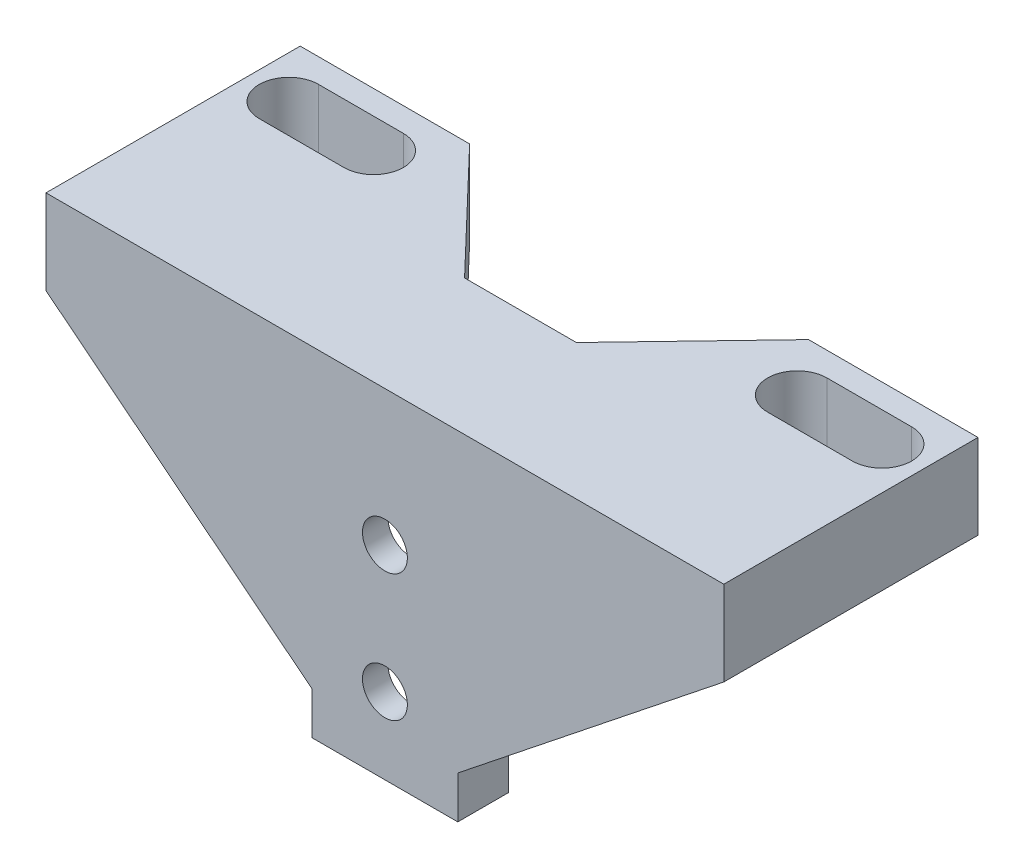
ISO-10303-21;
HEADER;
FILE_DESCRIPTION(('STEP AP214'),'2;1');
FILE_NAME('part.step','',(''),(''),'','','');
FILE_SCHEMA(('AUTOMOTIVE_DESIGN { 1 0 10303 214 1 1 1 1 }'));
ENDSEC;
DATA;
#1=APPLICATION_CONTEXT('core data for automotive mechanical design processes');
#2=APPLICATION_PROTOCOL_DEFINITION('international standard','automotive_design',2000,#1);
#3=PRODUCT_CONTEXT('',#1,'mechanical');
#4=PRODUCT('Part','Part','',(#3));
#5=PRODUCT_RELATED_PRODUCT_CATEGORY('part','',(#4));
#6=PRODUCT_DEFINITION_FORMATION('','',#4);
#7=PRODUCT_DEFINITION_CONTEXT('part definition',#1,'design');
#8=PRODUCT_DEFINITION('design','',#6,#7);
#9=PRODUCT_DEFINITION_SHAPE('','',#8);
#10=(LENGTH_UNIT() NAMED_UNIT(*) SI_UNIT(.MILLI.,.METRE.));
#11=(NAMED_UNIT(*) PLANE_ANGLE_UNIT() SI_UNIT($,.RADIAN.));
#12=(NAMED_UNIT(*) SI_UNIT($,.STERADIAN.) SOLID_ANGLE_UNIT());
#13=UNCERTAINTY_MEASURE_WITH_UNIT(LENGTH_MEASURE(1.E-05),#10,'distance_accuracy_value','');
#14=(GEOMETRIC_REPRESENTATION_CONTEXT(3) GLOBAL_UNCERTAINTY_ASSIGNED_CONTEXT((#13)) GLOBAL_UNIT_ASSIGNED_CONTEXT((#10,
#11,#12)) REPRESENTATION_CONTEXT('',''));
#15=CARTESIAN_POINT('',(0.,0.,0.));
#16=DIRECTION('',(0.,0.,1.));
#17=DIRECTION('',(1.,0.,0.));
#18=AXIS2_PLACEMENT_3D('',#15,#16,#17);
#19=CARTESIAN_POINT('',(0.,12.6831683168317,0.));
#20=DIRECTION('',(0.,1.,0.));
#21=DIRECTION('',(0.,0.,1.));
#22=AXIS2_PLACEMENT_3D('',#19,#20,#21);
#23=PLANE('',#22);
#24=DIRECTION('',(0.,0.,1.));
#25=VECTOR('',#24,1.);
#26=CARTESIAN_POINT('',(-7.03788894806055,12.6831683168317,-3.));
#27=LINE('',#26,#25);
#28=CARTESIAN_POINT('',(-7.03788894806055,12.6831683168317,-13.));
#29=VERTEX_POINT('',#28);
#30=CARTESIAN_POINT('',(-7.03788894806055,12.6831683168317,0.));
#31=VERTEX_POINT('',#30);
#32=EDGE_CURVE('E513',#29,#31,#27,.T.);
#33=ORIENTED_EDGE('',*,*,#32,.F.);
#34=DIRECTION('',(1.,0.,0.));
#35=VECTOR('',#34,1.);
#36=CARTESIAN_POINT('',(-7.03788894806055,12.6831683168317,-13.));
#37=LINE('',#36,#35);
#38=CARTESIAN_POINT('',(6.16211105193945,12.6831683168317,-13.));
#39=VERTEX_POINT('',#38);
#40=EDGE_CURVE('E412',#29,#39,#37,.T.);
#41=ORIENTED_EDGE('',*,*,#40,.T.);
#42=DIRECTION('',(0.,0.,1.));
#43=VECTOR('',#42,1.);
#44=CARTESIAN_POINT('',(6.16211105193945,12.6831683168317,-3.));
#45=LINE('',#44,#43);
#46=CARTESIAN_POINT('',(6.16211105193945,12.6831683168317,0.));
#47=VERTEX_POINT('',#46);
#48=EDGE_CURVE('E534',#39,#47,#45,.T.);
#49=ORIENTED_EDGE('',*,*,#48,.T.);
#50=DIRECTION('',(1.,0.,0.));
#51=VECTOR('',#50,1.);
#52=CARTESIAN_POINT('',(0.,12.6831683168317,0.));
#53=LINE('',#52,#51);
#54=EDGE_CURVE('E544',#31,#47,#53,.T.);
#55=ORIENTED_EDGE('',*,*,#54,.F.);
#56=EDGE_LOOP('',(#33,#41,#49,#55));
#57=FACE_BOUND('',#56,.T.);
#58=ADVANCED_FACE('F92',(#57),#23,.F.);
#59=DIRECTION('',(-1.,0.,0.));
#60=VECTOR('',#59,1.);
#61=CARTESIAN_POINT('',(0.,12.6831683168317,-17.1692178153389));
#62=LINE('',#61,#60);
#63=CARTESIAN_POINT('',(34.5621110519395,12.6831683168317,-17.1692178153389));
#64=VERTEX_POINT('',#63);
#65=CARTESIAN_POINT('',(24.5621110519394,12.6831683168317,-17.1692178153389));
#66=VERTEX_POINT('',#65);
#67=EDGE_CURVE('E352',#64,#66,#62,.T.);
#68=ORIENTED_EDGE('',*,*,#67,.F.);
#69=CARTESIAN_POINT('',(34.5621110519395,12.6831683168317,-20.6692178153389));
#70=DIRECTION('',(0.,1.,0.));
#71=DIRECTION('',(0.,0.,1.));
#72=AXIS2_PLACEMENT_3D('',#69,#70,#71);
#73=CIRCLE('',#72,3.49999999999999);
#74=CARTESIAN_POINT('',(34.5621110519395,12.6831683168317,-24.1692178153389));
#75=VERTEX_POINT('',#74);
#76=EDGE_CURVE('E355',#64,#75,#73,.T.);
#77=ORIENTED_EDGE('',*,*,#76,.T.);
#78=DIRECTION('',(-1.,0.,0.));
#79=VECTOR('',#78,1.);
#80=CARTESIAN_POINT('',(0.,12.6831683168317,-24.1692178153389));
#81=LINE('',#80,#79);
#82=CARTESIAN_POINT('',(24.5621110519394,12.6831683168317,-24.1692178153389));
#83=VERTEX_POINT('',#82);
#84=EDGE_CURVE('E312',#75,#83,#81,.T.);
#85=ORIENTED_EDGE('',*,*,#84,.T.);
#86=CARTESIAN_POINT('',(24.5621110519394,12.6831683168317,-20.6692178153389));
#87=DIRECTION('',(0.,1.,0.));
#88=DIRECTION('',(0.,0.,1.));
#89=AXIS2_PLACEMENT_3D('',#86,#87,#88);
#90=CIRCLE('',#89,3.49999999999999);
#91=EDGE_CURVE('E348',#83,#66,#90,.T.);
#92=ORIENTED_EDGE('',*,*,#91,.T.);
#93=EDGE_LOOP('',(#68,#77,#85,#92));
#94=FACE_BOUND('',#93,.T.);
#95=DIRECTION('',(0.,0.,1.));
#96=VECTOR('',#95,1.);
#97=CARTESIAN_POINT('',(39.5621110519394,12.6831683168317,0.));
#98=LINE('',#97,#96);
#99=CARTESIAN_POINT('',(39.5621110519394,12.6831683168317,-27.));
#100=VERTEX_POINT('',#99);
#101=CARTESIAN_POINT('',(39.5621110519394,12.6831683168317,-13.));
#102=VERTEX_POINT('',#101);
#103=EDGE_CURVE('E449',#100,#102,#98,.T.);
#104=ORIENTED_EDGE('',*,*,#103,.T.);
#105=DIRECTION('',(-1.,0.,0.));
#106=VECTOR('',#105,1.);
#107=CARTESIAN_POINT('',(0.,12.6831683168317,-13.));
#108=LINE('',#107,#106);
#109=EDGE_CURVE('E566',#102,#39,#108,.T.);
#110=ORIENTED_EDGE('',*,*,#109,.T.);
#111=DIRECTION('',(0.691456929285535,0.,-0.722417687313246));
#112=VECTOR('',#111,1.);
#113=CARTESIAN_POINT('',(-3.27784171322789,12.6831683168317,-3.13736278266098));
#114=LINE('',#113,#112);
#115=CARTESIAN_POINT('',(19.5621110519394,12.6831683168317,-27.));
#116=VERTEX_POINT('',#115);
#117=EDGE_CURVE('E456',#39,#116,#114,.T.);
#118=ORIENTED_EDGE('',*,*,#117,.T.);
#119=DIRECTION('',(-1.,0.,0.));
#120=VECTOR('',#119,1.);
#121=CARTESIAN_POINT('',(0.,12.6831683168317,-27.));
#122=LINE('',#121,#120);
#123=EDGE_CURVE('E452',#100,#116,#122,.T.);
#124=ORIENTED_EDGE('',*,*,#123,.F.);
#125=EDGE_LOOP('',(#104,#110,#118,#124));
#126=FACE_BOUND('',#125,.T.);
#127=ADVANCED_FACE('F589',(#94,#126),#23,.F.);
#128=CARTESIAN_POINT('',(8.16211105193945,0.,3.));
#129=DIRECTION('',(1.,0.,0.));
#130=DIRECTION('',(0.,1.,0.));
#131=AXIS2_PLACEMENT_3D('',#128,#129,#130);
#132=PLANE('',#131);
#133=DIRECTION('',(0.,-1.,0.));
#134=VECTOR('',#133,1.);
#135=CARTESIAN_POINT('',(8.16211105193945,0.,-3.));
#136=LINE('',#135,#134);
#137=CARTESIAN_POINT('',(8.16211105193945,-12.3168316831683,-3.00000000000002));
#138=VERTEX_POINT('',#137);
#139=CARTESIAN_POINT('',(8.16211105193945,-17.3168316831683,-3.));
#140=VERTEX_POINT('',#139);
#141=EDGE_CURVE('E520',#138,#140,#136,.T.);
#142=ORIENTED_EDGE('',*,*,#141,.F.);
#143=DIRECTION('',(0.,0.,1.));
#144=VECTOR('',#143,1.);
#145=CARTESIAN_POINT('',(8.16211105193945,-12.3168316831683,-43.136766187624));
#146=LINE('',#145,#144);
#147=CARTESIAN_POINT('',(8.16211105193945,-12.3168316831683,3.));
#148=VERTEX_POINT('',#147);
#149=EDGE_CURVE('E391',#138,#148,#146,.T.);
#150=ORIENTED_EDGE('',*,*,#149,.T.);
#151=DIRECTION('',(0.,-1.,0.));
#152=VECTOR('',#151,1.);
#153=CARTESIAN_POINT('',(8.16211105193945,0.,3.));
#154=LINE('',#153,#152);
#155=CARTESIAN_POINT('',(8.16211105193945,-17.3168316831683,3.));
#156=VERTEX_POINT('',#155);
#157=EDGE_CURVE('E543',#148,#156,#154,.T.);
#158=ORIENTED_EDGE('',*,*,#157,.T.);
#159=DIRECTION('',(0.,0.,-1.));
#160=VECTOR('',#159,1.);
#161=CARTESIAN_POINT('',(8.16211105193945,-17.3168316831683,3.));
#162=LINE('',#161,#160);
#163=EDGE_CURVE('E558',#156,#140,#162,.T.);
#164=ORIENTED_EDGE('',*,*,#163,.T.);
#165=EDGE_LOOP('',(#142,#150,#158,#164));
#166=FACE_BOUND('',#165,.T.);
#167=ADVANCED_FACE('F618',(#166),#132,.T.);
#168=CARTESIAN_POINT('',(0.,0.,0.));
#169=DIRECTION('',(0.,0.,1.));
#170=DIRECTION('',(1.,0.,0.));
#171=AXIS2_PLACEMENT_3D('',#168,#169,#170);
#172=PLANE('',#171);
#173=CARTESIAN_POINT('',(-0.43788894806055,6.68316831683169,0.));
#174=DIRECTION('',(0.,0.,-1.));
#175=DIRECTION('',(-1.,0.,0.));
#176=AXIS2_PLACEMENT_3D('',#173,#174,#175);
#177=CIRCLE('',#176,2.65);
#178=CARTESIAN_POINT('',(-3.08788894806055,6.68316831683169,0.));
#179=VERTEX_POINT('',#178);
#180=EDGE_CURVE('E377',#179,#179,#177,.T.);
#181=ORIENTED_EDGE('',*,*,#180,.F.);
#182=EDGE_LOOP('',(#181));
#183=FACE_BOUND('',#182,.T.);
#184=CARTESIAN_POINT('',(-0.437888948060552,-8.31683168316831,0.));
#185=DIRECTION('',(0.,0.,-1.));
#186=DIRECTION('',(-1.,0.,0.));
#187=AXIS2_PLACEMENT_3D('',#184,#185,#186);
#188=CIRCLE('',#187,2.65);
#189=CARTESIAN_POINT('',(-3.08788894806055,-8.31683168316831,0.));
#190=VERTEX_POINT('',#189);
#191=EDGE_CURVE('E381',#190,#190,#188,.T.);
#192=ORIENTED_EDGE('',*,*,#191,.F.);
#193=EDGE_LOOP('',(#192));
#194=FACE_BOUND('',#193,.T.);
#195=DIRECTION('',(0.,-1.,0.));
#196=VECTOR('',#195,1.);
#197=CARTESIAN_POINT('',(-7.03788894806055,0.,0.));
#198=LINE('',#197,#196);
#199=CARTESIAN_POINT('',(-7.03788894806055,-17.3168316831683,0.));
#200=VERTEX_POINT('',#199);
#201=EDGE_CURVE('E489',#31,#200,#198,.T.);
#202=ORIENTED_EDGE('',*,*,#201,.F.);
#203=ORIENTED_EDGE('',*,*,#54,.T.);
#204=DIRECTION('',(0.,-1.,0.));
#205=VECTOR('',#204,1.);
#206=CARTESIAN_POINT('',(6.16211105193945,0.,0.));
#207=LINE('',#206,#205);
#208=CARTESIAN_POINT('',(6.16211105193945,-17.3168316831683,0.));
#209=VERTEX_POINT('',#208);
#210=EDGE_CURVE('E516',#47,#209,#207,.T.);
#211=ORIENTED_EDGE('',*,*,#210,.T.);
#212=DIRECTION('',(1.,0.,0.));
#213=VECTOR('',#212,1.);
#214=CARTESIAN_POINT('',(0.,-17.3168316831683,0.));
#215=LINE('',#214,#213);
#216=EDGE_CURVE('E538',#200,#209,#215,.T.);
#217=ORIENTED_EDGE('',*,*,#216,.F.);
#218=EDGE_LOOP('',(#202,#203,#211,#217));
#219=FACE_BOUND('',#218,.T.);
#220=ADVANCED_FACE('F630',(#183,#194,#219),#172,.F.);
#221=CARTESIAN_POINT('',(0.,-17.3168316831683,3.));
#222=DIRECTION('',(0.,1.,0.));
#223=DIRECTION('',(0.,0.,1.));
#224=AXIS2_PLACEMENT_3D('',#221,#222,#223);
#225=PLANE('',#224);
#226=DIRECTION('',(0.,0.,-1.));
#227=VECTOR('',#226,1.);
#228=CARTESIAN_POINT('',(-9.03788894806055,-17.3168316831683,3.));
#229=LINE('',#228,#227);
#230=CARTESIAN_POINT('',(-9.03788894806055,-17.3168316831683,3.));
#231=VERTEX_POINT('',#230);
#232=CARTESIAN_POINT('',(-9.03788894806055,-17.3168316831683,-3.));
#233=VERTEX_POINT('',#232);
#234=EDGE_CURVE('E550',#231,#233,#229,.T.);
#235=ORIENTED_EDGE('',*,*,#234,.T.);
#236=DIRECTION('',(-1.,0.,0.));
#237=VECTOR('',#236,1.);
#238=CARTESIAN_POINT('',(0.,-17.3168316831683,-3.));
#239=LINE('',#238,#237);
#240=CARTESIAN_POINT('',(-7.03788894806055,-17.3168316831683,-3.));
#241=VERTEX_POINT('',#240);
#242=EDGE_CURVE('E499',#241,#233,#239,.T.);
#243=ORIENTED_EDGE('',*,*,#242,.F.);
#244=DIRECTION('',(0.,0.,1.));
#245=VECTOR('',#244,1.);
#246=CARTESIAN_POINT('',(-7.03788894806055,-17.3168316831683,-3.));
#247=LINE('',#246,#245);
#248=EDGE_CURVE('E507',#241,#200,#247,.T.);
#249=ORIENTED_EDGE('',*,*,#248,.T.);
#250=ORIENTED_EDGE('',*,*,#216,.T.);
#251=DIRECTION('',(0.,0.,1.));
#252=VECTOR('',#251,1.);
#253=CARTESIAN_POINT('',(6.16211105193945,-17.3168316831683,-3.));
#254=LINE('',#253,#252);
#255=CARTESIAN_POINT('',(6.16211105193945,-17.3168316831683,-3.));
#256=VERTEX_POINT('',#255);
#257=EDGE_CURVE('E527',#256,#209,#254,.T.);
#258=ORIENTED_EDGE('',*,*,#257,.F.);
#259=DIRECTION('',(-1.,0.,0.));
#260=VECTOR('',#259,1.);
#261=CARTESIAN_POINT('',(0.,-17.3168316831683,-3.));
#262=LINE('',#261,#260);
#263=EDGE_CURVE('E523',#140,#256,#262,.T.);
#264=ORIENTED_EDGE('',*,*,#263,.F.);
#265=ORIENTED_EDGE('',*,*,#163,.F.);
#266=DIRECTION('',(1.,0.,0.));
#267=VECTOR('',#266,1.);
#268=CARTESIAN_POINT('',(0.,-17.3168316831683,3.));
#269=LINE('',#268,#267);
#270=EDGE_CURVE('E539',#231,#156,#269,.T.);
#271=ORIENTED_EDGE('',*,*,#270,.F.);
#272=EDGE_LOOP('',(#235,#243,#249,#250,#258,#264,#265,#271));
#273=FACE_BOUND('',#272,.T.);
#274=ADVANCED_FACE('F637',(#273),#225,.F.);
#275=CARTESIAN_POINT('',(-9.03788894806055,0.,3.));
#276=DIRECTION('',(1.,0.,0.));
#277=DIRECTION('',(0.,1.,0.));
#278=AXIS2_PLACEMENT_3D('',#275,#276,#277);
#279=PLANE('',#278);
#280=DIRECTION('',(0.,-1.,0.));
#281=VECTOR('',#280,1.);
#282=CARTESIAN_POINT('',(-9.03788894806055,0.,3.));
#283=LINE('',#282,#281);
#284=CARTESIAN_POINT('',(-9.03788894806055,-12.3168316831683,3.));
#285=VERTEX_POINT('',#284);
#286=EDGE_CURVE('E547',#285,#231,#283,.T.);
#287=ORIENTED_EDGE('',*,*,#286,.F.);
#288=DIRECTION('',(0.,0.,1.));
#289=VECTOR('',#288,1.);
#290=CARTESIAN_POINT('',(-9.03788894806055,-12.3168316831683,-43.136766187624));
#291=LINE('',#290,#289);
#292=CARTESIAN_POINT('',(-9.03788894806055,-12.3168316831683,-3.00000000000002));
#293=VERTEX_POINT('',#292);
#294=EDGE_CURVE('E407',#293,#285,#291,.T.);
#295=ORIENTED_EDGE('',*,*,#294,.F.);
#296=DIRECTION('',(0.,1.,0.));
#297=VECTOR('',#296,1.);
#298=CARTESIAN_POINT('',(-9.03788894806055,0.,-3.));
#299=LINE('',#298,#297);
#300=EDGE_CURVE('E503',#233,#293,#299,.T.);
#301=ORIENTED_EDGE('',*,*,#300,.F.);
#302=ORIENTED_EDGE('',*,*,#234,.F.);
#303=EDGE_LOOP('',(#287,#295,#301,#302));
#304=FACE_BOUND('',#303,.T.);
#305=ADVANCED_FACE('F646',(#304),#279,.F.);
#306=CARTESIAN_POINT('',(0.,0.,3.));
#307=DIRECTION('',(0.,0.,1.));
#308=DIRECTION('',(1.,0.,0.));
#309=AXIS2_PLACEMENT_3D('',#306,#307,#308);
#310=PLANE('',#309);
#311=CARTESIAN_POINT('',(-0.43788894806055,6.68316831683169,3.00000000000001));
#312=DIRECTION('',(0.,0.,-1.));
#313=DIRECTION('',(-1.,0.,0.));
#314=AXIS2_PLACEMENT_3D('',#311,#312,#313);
#315=CIRCLE('',#314,2.65);
#316=CARTESIAN_POINT('',(-3.08788894806055,6.68316831683169,3.00000000000001));
#317=VERTEX_POINT('',#316);
#318=EDGE_CURVE('E373',#317,#317,#315,.T.);
#319=ORIENTED_EDGE('',*,*,#318,.T.);
#320=EDGE_LOOP('',(#319));
#321=FACE_BOUND('',#320,.T.);
#322=CARTESIAN_POINT('',(-0.437888948060552,-8.31683168316831,3.00000000000001));
#323=DIRECTION('',(0.,0.,-1.));
#324=DIRECTION('',(-1.,0.,0.));
#325=AXIS2_PLACEMENT_3D('',#322,#323,#324);
#326=CIRCLE('',#325,2.65);
#327=CARTESIAN_POINT('',(-3.08788894806055,-8.31683168316831,3.00000000000001));
#328=VERTEX_POINT('',#327);
#329=EDGE_CURVE('E372',#328,#328,#326,.T.);
#330=ORIENTED_EDGE('',*,*,#329,.T.);
#331=EDGE_LOOP('',(#330));
#332=FACE_BOUND('',#331,.T.);
#333=ORIENTED_EDGE('',*,*,#157,.F.);
#334=DIRECTION('',(-0.782325109432509,-0.62287031005773,0.));
#335=VECTOR('',#334,1.);
#336=CARTESIAN_POINT('',(9.16846618087928,-11.5155935231844,3.));
#337=LINE('',#336,#335);
#338=CARTESIAN_POINT('',(39.5621110519394,12.6831683168317,3.));
#339=VERTEX_POINT('',#338);
#340=EDGE_CURVE('E388',#339,#148,#337,.T.);
#341=ORIENTED_EDGE('',*,*,#340,.F.);
#342=DIRECTION('',(0.,-1.,0.));
#343=VECTOR('',#342,1.);
#344=CARTESIAN_POINT('',(39.5621110519394,22.6831683168317,3.00000000000001));
#345=LINE('',#344,#343);
#346=CARTESIAN_POINT('',(39.5621110519394,22.6831683168317,3.00000000000001));
#347=VERTEX_POINT('',#346);
#348=EDGE_CURVE('E479',#347,#339,#345,.T.);
#349=ORIENTED_EDGE('',*,*,#348,.F.);
#350=DIRECTION('',(1.,0.,0.));
#351=VECTOR('',#350,1.);
#352=CARTESIAN_POINT('',(0.,22.6831683168317,3.));
#353=LINE('',#352,#351);
#354=CARTESIAN_POINT('',(-40.4378889480606,22.6831683168317,3.00000000000001));
#355=VERTEX_POINT('',#354);
#356=EDGE_CURVE('E421',#355,#347,#353,.T.);
#357=ORIENTED_EDGE('',*,*,#356,.F.);
#358=DIRECTION('',(0.,-1.,0.));
#359=VECTOR('',#358,1.);
#360=CARTESIAN_POINT('',(-40.4378889480606,22.6831683168317,3.00000000000001));
#361=LINE('',#360,#359);
#362=CARTESIAN_POINT('',(-40.4378889480606,12.6831683168317,3.00000000000001));
#363=VERTEX_POINT('',#362);
#364=EDGE_CURVE('E482',#355,#363,#361,.T.);
#365=ORIENTED_EDGE('',*,*,#364,.T.);
#366=DIRECTION('',(0.782325109432509,-0.62287031005773,0.));
#367=VECTOR('',#366,1.);
#368=CARTESIAN_POINT('',(-9.50823947449035,-11.9423487799599,3.));
#369=LINE('',#368,#367);
#370=EDGE_CURVE('E395',#363,#285,#369,.T.);
#371=ORIENTED_EDGE('',*,*,#370,.T.);
#372=ORIENTED_EDGE('',*,*,#286,.T.);
#373=ORIENTED_EDGE('',*,*,#270,.T.);
#374=EDGE_LOOP('',(#333,#341,#349,#357,#365,#371,#372,#373));
#375=FACE_BOUND('',#374,.T.);
#376=ADVANCED_FACE('F615',(#321,#332,#375),#310,.T.);
#377=CARTESIAN_POINT('',(6.16211105193945,0.,-3.));
#378=DIRECTION('',(-1.,0.,0.));
#379=DIRECTION('',(0.,0.,1.));
#380=AXIS2_PLACEMENT_3D('',#377,#378,#379);
#381=PLANE('',#380);
#382=ORIENTED_EDGE('',*,*,#210,.F.);
#383=ORIENTED_EDGE('',*,*,#48,.F.);
#384=DIRECTION('',(0.,-0.707106781186551,0.707106781186544));
#385=VECTOR('',#384,1.);
#386=CARTESIAN_POINT('',(6.16211105193945,2.68316831683163,-3.));
#387=LINE('',#386,#385);
#388=CARTESIAN_POINT('',(6.16211105193945,2.68316831683163,-3.));
#389=VERTEX_POINT('',#388);
#390=EDGE_CURVE('E12',#39,#389,#387,.T.);
#391=ORIENTED_EDGE('',*,*,#390,.T.);
#392=DIRECTION('',(0.,-1.,0.));
#393=VECTOR('',#392,1.);
#394=CARTESIAN_POINT('',(6.16211105193945,0.,-3.));
#395=LINE('',#394,#393);
#396=EDGE_CURVE('E517',#389,#256,#395,.T.);
#397=ORIENTED_EDGE('',*,*,#396,.T.);
#398=ORIENTED_EDGE('',*,*,#257,.T.);
#399=EDGE_LOOP('',(#382,#383,#391,#397,#398));
#400=FACE_BOUND('',#399,.T.);
#401=ADVANCED_FACE('F626',(#400),#381,.T.);
#402=CARTESIAN_POINT('',(0.,0.,-3.));
#403=DIRECTION('',(0.,0.,-1.));
#404=DIRECTION('',(-1.,0.,0.));
#405=AXIS2_PLACEMENT_3D('',#402,#403,#404);
#406=PLANE('',#405);
#407=ORIENTED_EDGE('',*,*,#396,.F.);
#408=DIRECTION('',(1.,0.,0.));
#409=VECTOR('',#408,1.);
#410=CARTESIAN_POINT('',(0.,2.68316831683163,-3.));
#411=LINE('',#410,#409);
#412=CARTESIAN_POINT('',(27.0021110519394,2.68316831683163,-3.));
#413=VERTEX_POINT('',#412);
#414=EDGE_CURVE('E573',#389,#413,#411,.T.);
#415=ORIENTED_EDGE('',*,*,#414,.T.);
#416=DIRECTION('',(-0.782325109432509,-0.62287031005773,0.));
#417=VECTOR('',#416,1.);
#418=CARTESIAN_POINT('',(9.16846618087928,-11.5155935231844,-3.));
#419=LINE('',#418,#417);
#420=EDGE_CURVE('E392',#413,#138,#419,.T.);
#421=ORIENTED_EDGE('',*,*,#420,.T.);
#422=ORIENTED_EDGE('',*,*,#141,.T.);
#423=ORIENTED_EDGE('',*,*,#263,.T.);
#424=EDGE_LOOP('',(#407,#415,#421,#422,#423));
#425=FACE_BOUND('',#424,.T.);
#426=ADVANCED_FACE('F623',(#425),#406,.T.);
#427=CARTESIAN_POINT('',(-7.03788894806055,0.,-3.));
#428=DIRECTION('',(-1.,0.,0.));
#429=DIRECTION('',(0.,-1.,0.));
#430=AXIS2_PLACEMENT_3D('',#427,#428,#429);
#431=PLANE('',#430);
#432=ORIENTED_EDGE('',*,*,#201,.T.);
#433=ORIENTED_EDGE('',*,*,#248,.F.);
#434=DIRECTION('',(0.,-1.,0.));
#435=VECTOR('',#434,1.);
#436=CARTESIAN_POINT('',(-7.03788894806055,0.,-3.));
#437=LINE('',#436,#435);
#438=CARTESIAN_POINT('',(-7.03788894806055,2.68316831683163,-3.));
#439=VERTEX_POINT('',#438);
#440=EDGE_CURVE('E496',#439,#241,#437,.T.);
#441=ORIENTED_EDGE('',*,*,#440,.F.);
#442=DIRECTION('',(0.,0.707106781186551,-0.707106781186544));
#443=VECTOR('',#442,1.);
#444=CARTESIAN_POINT('',(-7.03788894806055,1.3415841584158,-1.65841584158418));
#445=LINE('',#444,#443);
#446=EDGE_CURVE('E576',#439,#29,#445,.T.);
#447=ORIENTED_EDGE('',*,*,#446,.T.);
#448=ORIENTED_EDGE('',*,*,#32,.T.);
#449=EDGE_LOOP('',(#432,#433,#441,#447,#448));
#450=FACE_BOUND('',#449,.T.);
#451=ADVANCED_FACE('F633',(#450),#431,.F.);
#452=CARTESIAN_POINT('',(0.,0.,-3.));
#453=DIRECTION('',(0.,0.,-1.));
#454=DIRECTION('',(-1.,0.,0.));
#455=AXIS2_PLACEMENT_3D('',#452,#453,#454);
#456=PLANE('',#455);
#457=DIRECTION('',(0.782325109432509,-0.62287031005773,0.));
#458=VECTOR('',#457,1.);
#459=CARTESIAN_POINT('',(-9.50823947449035,-11.9423487799599,-3.));
#460=LINE('',#459,#458);
#461=CARTESIAN_POINT('',(-27.8778889480605,2.68316831683164,-3.));
#462=VERTEX_POINT('',#461);
#463=EDGE_CURVE('E404',#462,#293,#460,.T.);
#464=ORIENTED_EDGE('',*,*,#463,.F.);
#465=DIRECTION('',(1.,0.,0.));
#466=VECTOR('',#465,1.);
#467=CARTESIAN_POINT('',(0.,2.68316831683163,-3.));
#468=LINE('',#467,#466);
#469=EDGE_CURVE('E562',#462,#439,#468,.T.);
#470=ORIENTED_EDGE('',*,*,#469,.T.);
#471=ORIENTED_EDGE('',*,*,#440,.T.);
#472=ORIENTED_EDGE('',*,*,#242,.T.);
#473=ORIENTED_EDGE('',*,*,#300,.T.);
#474=EDGE_LOOP('',(#464,#470,#471,#472,#473));
#475=FACE_BOUND('',#474,.T.);
#476=ADVANCED_FACE('F642',(#475),#456,.T.);
#477=CARTESIAN_POINT('',(2.82078433853481,22.6831683168317,-2.69989358116903));
#478=DIRECTION('',(0.722417687313246,0.,-0.691456929285535));
#479=DIRECTION('',(-0.691456929285535,0.,-0.722417687313246));
#480=AXIS2_PLACEMENT_3D('',#477,#478,#479);
#481=PLANE('',#480);
#482=DIRECTION('',(0.691456929285535,0.,0.722417687313246));
#483=VECTOR('',#482,1.);
#484=CARTESIAN_POINT('',(2.82078433853481,12.6831683168317,-2.69989358116903));
#485=LINE('',#484,#483);
#486=CARTESIAN_POINT('',(-20.4378889480606,12.6831683168317,-27.));
#487=VERTEX_POINT('',#486);
#488=EDGE_CURVE('E418',#487,#29,#485,.T.);
#489=ORIENTED_EDGE('',*,*,#488,.F.);
#490=DIRECTION('',(0.,-1.,0.));
#491=VECTOR('',#490,1.);
#492=CARTESIAN_POINT('',(-20.4378889480606,22.6831683168317,-27.));
#493=LINE('',#492,#491);
#494=CARTESIAN_POINT('',(-20.4378889480606,22.6831683168317,-27.));
#495=VERTEX_POINT('',#494);
#496=EDGE_CURVE('E439',#495,#487,#493,.T.);
#497=ORIENTED_EDGE('',*,*,#496,.F.);
#498=DIRECTION('',(0.691456929285535,0.,0.722417687313246));
#499=VECTOR('',#498,1.);
#500=CARTESIAN_POINT('',(2.82078433853481,22.6831683168317,-2.69989358116903));
#501=LINE('',#500,#499);
#502=CARTESIAN_POINT('',(-7.03788894806055,22.6831683168317,-13.));
#503=VERTEX_POINT('',#502);
#504=EDGE_CURVE('E435',#495,#503,#501,.T.);
#505=ORIENTED_EDGE('',*,*,#504,.T.);
#506=DIRECTION('',(0.,-1.,0.));
#507=VECTOR('',#506,1.);
#508=CARTESIAN_POINT('',(-7.03788894806055,22.6831683168317,-13.));
#509=LINE('',#508,#507);
#510=EDGE_CURVE('E465',#503,#29,#509,.T.);
#511=ORIENTED_EDGE('',*,*,#510,.T.);
#512=EDGE_LOOP('',(#489,#497,#505,#511));
#513=FACE_BOUND('',#512,.T.);
#514=ADVANCED_FACE('F659',(#513),#481,.T.);
#515=CARTESIAN_POINT('',(0.,22.6831683168317,-27.));
#516=DIRECTION('',(0.,0.,-1.));
#517=DIRECTION('',(-1.,0.,0.));
#518=AXIS2_PLACEMENT_3D('',#515,#516,#517);
#519=PLANE('',#518);
#520=DIRECTION('',(1.,0.,0.));
#521=VECTOR('',#520,1.);
#522=CARTESIAN_POINT('',(0.,12.6831683168317,-27.));
#523=LINE('',#522,#521);
#524=CARTESIAN_POINT('',(-40.4378889480606,12.6831683168317,-27.));
#525=VERTEX_POINT('',#524);
#526=EDGE_CURVE('E440',#525,#487,#523,.T.);
#527=ORIENTED_EDGE('',*,*,#526,.F.);
#528=DIRECTION('',(0.,-1.,0.));
#529=VECTOR('',#528,1.);
#530=CARTESIAN_POINT('',(-40.4378889480606,22.6831683168317,-27.));
#531=LINE('',#530,#529);
#532=CARTESIAN_POINT('',(-40.4378889480606,22.6831683168317,-27.));
#533=VERTEX_POINT('',#532);
#534=EDGE_CURVE('E486',#533,#525,#531,.T.);
#535=ORIENTED_EDGE('',*,*,#534,.F.);
#536=DIRECTION('',(1.,0.,0.));
#537=VECTOR('',#536,1.);
#538=CARTESIAN_POINT('',(0.,22.6831683168317,-27.));
#539=LINE('',#538,#537);
#540=EDGE_CURVE('E413',#533,#495,#539,.T.);
#541=ORIENTED_EDGE('',*,*,#540,.T.);
#542=ORIENTED_EDGE('',*,*,#496,.T.);
#543=EDGE_LOOP('',(#527,#535,#541,#542));
#544=FACE_BOUND('',#543,.T.);
#545=ADVANCED_FACE('F662',(#544),#519,.T.);
#546=CARTESIAN_POINT('',(-40.4378889480606,22.6831683168317,0.));
#547=DIRECTION('',(1.,0.,0.));
#548=DIRECTION('',(0.,0.,-1.));
#549=AXIS2_PLACEMENT_3D('',#546,#547,#548);
#550=PLANE('',#549);
#551=DIRECTION('',(0.,0.,1.));
#552=VECTOR('',#551,1.);
#553=CARTESIAN_POINT('',(-40.4378889480606,12.6831683168317,0.));
#554=LINE('',#553,#552);
#555=CARTESIAN_POINT('',(-40.4378889480606,12.6831683168317,-13.));
#556=VERTEX_POINT('',#555);
#557=EDGE_CURVE('E444',#525,#556,#554,.T.);
#558=ORIENTED_EDGE('',*,*,#557,.T.);
#559=DIRECTION('',(0.,0.,1.));
#560=VECTOR('',#559,1.);
#561=CARTESIAN_POINT('',(-40.4378889480606,12.6831683168317,-43.136766187624));
#562=LINE('',#561,#560);
#563=EDGE_CURVE('E127',#556,#363,#562,.T.);
#564=ORIENTED_EDGE('',*,*,#563,.T.);
#565=ORIENTED_EDGE('',*,*,#364,.F.);
#566=DIRECTION('',(0.,0.,1.));
#567=VECTOR('',#566,1.);
#568=CARTESIAN_POINT('',(-40.4378889480606,22.6831683168317,0.));
#569=LINE('',#568,#567);
#570=EDGE_CURVE('E417',#533,#355,#569,.T.);
#571=ORIENTED_EDGE('',*,*,#570,.F.);
#572=ORIENTED_EDGE('',*,*,#534,.T.);
#573=EDGE_LOOP('',(#558,#564,#565,#571,#572));
#574=FACE_BOUND('',#573,.T.);
#575=ADVANCED_FACE('F649',(#574),#550,.F.);
#576=CARTESIAN_POINT('',(39.5621110519394,22.6831683168317,0.));
#577=DIRECTION('',(1.,0.,0.));
#578=DIRECTION('',(0.,0.,-1.));
#579=AXIS2_PLACEMENT_3D('',#576,#577,#578);
#580=PLANE('',#579);
#581=ORIENTED_EDGE('',*,*,#103,.F.);
#582=DIRECTION('',(0.,-1.,0.));
#583=VECTOR('',#582,1.);
#584=CARTESIAN_POINT('',(39.5621110519394,22.6831683168317,-27.));
#585=LINE('',#584,#583);
#586=CARTESIAN_POINT('',(39.5621110519394,22.6831683168317,-27.));
#587=VERTEX_POINT('',#586);
#588=EDGE_CURVE('E476',#587,#100,#585,.T.);
#589=ORIENTED_EDGE('',*,*,#588,.F.);
#590=DIRECTION('',(0.,0.,1.));
#591=VECTOR('',#590,1.);
#592=CARTESIAN_POINT('',(39.5621110519394,22.6831683168317,0.));
#593=LINE('',#592,#591);
#594=EDGE_CURVE('E424',#587,#347,#593,.T.);
#595=ORIENTED_EDGE('',*,*,#594,.T.);
#596=ORIENTED_EDGE('',*,*,#348,.T.);
#597=DIRECTION('',(0.,0.,1.));
#598=VECTOR('',#597,1.);
#599=CARTESIAN_POINT('',(39.5621110519394,12.6831683168317,-43.136766187624));
#600=LINE('',#599,#598);
#601=EDGE_CURVE('E108',#102,#339,#600,.T.);
#602=ORIENTED_EDGE('',*,*,#601,.F.);
#603=EDGE_LOOP('',(#581,#589,#595,#596,#602));
#604=FACE_BOUND('',#603,.T.);
#605=ADVANCED_FACE('F605',(#604),#580,.T.);
#606=CARTESIAN_POINT('',(0.,22.6831683168317,-27.));
#607=DIRECTION('',(0.,0.,1.));
#608=DIRECTION('',(1.,0.,0.));
#609=AXIS2_PLACEMENT_3D('',#606,#607,#608);
#610=PLANE('',#609);
#611=ORIENTED_EDGE('',*,*,#123,.T.);
#612=DIRECTION('',(0.,-1.,0.));
#613=VECTOR('',#612,1.);
#614=CARTESIAN_POINT('',(19.5621110519394,22.6831683168317,-27.));
#615=LINE('',#614,#613);
#616=CARTESIAN_POINT('',(19.5621110519394,22.6831683168317,-27.));
#617=VERTEX_POINT('',#616);
#618=EDGE_CURVE('E473',#617,#116,#615,.T.);
#619=ORIENTED_EDGE('',*,*,#618,.F.);
#620=DIRECTION('',(-1.,0.,0.));
#621=VECTOR('',#620,1.);
#622=CARTESIAN_POINT('',(0.,22.6831683168317,-27.));
#623=LINE('',#622,#621);
#624=EDGE_CURVE('E428',#587,#617,#623,.T.);
#625=ORIENTED_EDGE('',*,*,#624,.F.);
#626=ORIENTED_EDGE('',*,*,#588,.T.);
#627=EDGE_LOOP('',(#611,#619,#625,#626));
#628=FACE_BOUND('',#627,.T.);
#629=ADVANCED_FACE('F604',(#628),#610,.F.);
#630=CARTESIAN_POINT('',(-3.27784171322789,22.6831683168317,-3.13736278266098));
#631=DIRECTION('',(-0.722417687313246,0.,-0.691456929285535));
#632=DIRECTION('',(-0.691456929285535,0.,0.722417687313246));
#633=AXIS2_PLACEMENT_3D('',#630,#631,#632);
#634=PLANE('',#633);
#635=ORIENTED_EDGE('',*,*,#117,.F.);
#636=DIRECTION('',(0.,-1.,0.));
#637=VECTOR('',#636,1.);
#638=CARTESIAN_POINT('',(6.16211105193945,22.6831683168317,-13.));
#639=LINE('',#638,#637);
#640=CARTESIAN_POINT('',(6.16211105193945,22.6831683168317,-13.));
#641=VERTEX_POINT('',#640);
#642=EDGE_CURVE('E469',#641,#39,#639,.T.);
#643=ORIENTED_EDGE('',*,*,#642,.F.);
#644=DIRECTION('',(0.691456929285535,0.,-0.722417687313246));
#645=VECTOR('',#644,1.);
#646=CARTESIAN_POINT('',(-3.27784171322789,22.6831683168317,-3.13736278266098));
#647=LINE('',#646,#645);
#648=EDGE_CURVE('E431',#641,#617,#647,.T.);
#649=ORIENTED_EDGE('',*,*,#648,.T.);
#650=ORIENTED_EDGE('',*,*,#618,.T.);
#651=EDGE_LOOP('',(#635,#643,#649,#650));
#652=FACE_BOUND('',#651,.T.);
#653=ADVANCED_FACE('F600',(#652),#634,.T.);
#654=CARTESIAN_POINT('',(-25.4378889480606,12.6831683168317,-20.6692178153389));
#655=DIRECTION('',(0.,1.,0.));
#656=DIRECTION('',(0.,0.,1.));
#657=AXIS2_PLACEMENT_3D('',#654,#655,#656);
#658=CIRCLE('',#657,3.5);
#659=CARTESIAN_POINT('',(-25.4378889480606,12.6831683168317,-17.1692178153389));
#660=VERTEX_POINT('',#659);
#661=CARTESIAN_POINT('',(-25.4378889480606,12.6831683168317,-24.1692178153389));
#662=VERTEX_POINT('',#661);
#663=EDGE_CURVE('E364',#660,#662,#658,.T.);
#664=ORIENTED_EDGE('',*,*,#663,.T.);
#665=DIRECTION('',(-1.,0.,0.));
#666=VECTOR('',#665,1.);
#667=CARTESIAN_POINT('',(0.,12.6831683168317,-24.1692178153389));
#668=LINE('',#667,#666);
#669=CARTESIAN_POINT('',(-35.4378889480606,12.6831683168317,-24.1692178153389));
#670=VERTEX_POINT('',#669);
#671=EDGE_CURVE('E368',#662,#670,#668,.T.);
#672=ORIENTED_EDGE('',*,*,#671,.T.);
#673=CARTESIAN_POINT('',(-35.4378889480606,12.6831683168317,-20.6692178153389));
#674=DIRECTION('',(0.,1.,0.));
#675=DIRECTION('',(0.,0.,1.));
#676=AXIS2_PLACEMENT_3D('',#673,#674,#675);
#677=CIRCLE('',#676,3.5);
#678=CARTESIAN_POINT('',(-35.4378889480606,12.6831683168317,-17.1692178153389));
#679=VERTEX_POINT('',#678);
#680=EDGE_CURVE('E359',#670,#679,#677,.T.);
#681=ORIENTED_EDGE('',*,*,#680,.T.);
#682=DIRECTION('',(-1.,0.,0.));
#683=VECTOR('',#682,1.);
#684=CARTESIAN_POINT('',(0.,12.6831683168317,-17.1692178153389));
#685=LINE('',#684,#683);
#686=EDGE_CURVE('E282',#660,#679,#685,.T.);
#687=ORIENTED_EDGE('',*,*,#686,.F.);
#688=EDGE_LOOP('',(#664,#672,#681,#687));
#689=FACE_BOUND('',#688,.T.);
#690=ORIENTED_EDGE('',*,*,#488,.T.);
#691=DIRECTION('',(-1.,0.,0.));
#692=VECTOR('',#691,1.);
#693=CARTESIAN_POINT('',(0.,12.6831683168317,-13.));
#694=LINE('',#693,#692);
#695=EDGE_CURVE('E570',#29,#556,#694,.T.);
#696=ORIENTED_EDGE('',*,*,#695,.T.);
#697=ORIENTED_EDGE('',*,*,#557,.F.);
#698=ORIENTED_EDGE('',*,*,#526,.T.);
#699=EDGE_LOOP('',(#690,#696,#697,#698));
#700=FACE_BOUND('',#699,.T.);
#701=ADVANCED_FACE('F663',(#689,#700),#23,.F.);
#702=CARTESIAN_POINT('',(0.,22.6831683168317,0.));
#703=DIRECTION('',(0.,1.,0.));
#704=DIRECTION('',(0.,0.,1.));
#705=AXIS2_PLACEMENT_3D('',#702,#703,#704);
#706=PLANE('',#705);
#707=DIRECTION('',(-1.,0.,0.));
#708=VECTOR('',#707,1.);
#709=CARTESIAN_POINT('',(0.,22.6831683168317,-24.1692178153389));
#710=LINE('',#709,#708);
#711=CARTESIAN_POINT('',(-25.4378889480606,22.6831683168317,-24.1692178153389));
#712=VERTEX_POINT('',#711);
#713=CARTESIAN_POINT('',(-35.4378889480606,22.6831683168317,-24.1692178153389));
#714=VERTEX_POINT('',#713);
#715=EDGE_CURVE('E297',#712,#714,#710,.T.);
#716=ORIENTED_EDGE('',*,*,#715,.F.);
#717=CARTESIAN_POINT('',(-25.4378889480606,22.6831683168317,-20.6692178153389));
#718=DIRECTION('',(0.,1.,0.));
#719=DIRECTION('',(0.,0.,1.));
#720=AXIS2_PLACEMENT_3D('',#717,#718,#719);
#721=CIRCLE('',#720,3.5);
#722=CARTESIAN_POINT('',(-25.4378889480606,22.6831683168317,-17.1692178153389));
#723=VERTEX_POINT('',#722);
#724=EDGE_CURVE('E302',#723,#712,#721,.T.);
#725=ORIENTED_EDGE('',*,*,#724,.F.);
#726=DIRECTION('',(-1.,0.,0.));
#727=VECTOR('',#726,1.);
#728=CARTESIAN_POINT('',(0.,22.6831683168317,-17.1692178153389));
#729=LINE('',#728,#727);
#730=CARTESIAN_POINT('',(-35.4378889480606,22.6831683168317,-17.1692178153389));
#731=VERTEX_POINT('',#730);
#732=EDGE_CURVE('E279',#723,#731,#729,.T.);
#733=ORIENTED_EDGE('',*,*,#732,.T.);
#734=CARTESIAN_POINT('',(-35.4378889480606,22.6831683168317,-20.6692178153389));
#735=DIRECTION('',(0.,1.,0.));
#736=DIRECTION('',(0.,0.,1.));
#737=AXIS2_PLACEMENT_3D('',#734,#735,#736);
#738=CIRCLE('',#737,3.5);
#739=EDGE_CURVE('E291',#714,#731,#738,.T.);
#740=ORIENTED_EDGE('',*,*,#739,.F.);
#741=EDGE_LOOP('',(#716,#725,#733,#740));
#742=FACE_BOUND('',#741,.T.);
#743=CARTESIAN_POINT('',(34.5621110519395,22.6831683168317,-20.6692178153389));
#744=DIRECTION('',(0.,1.,0.));
#745=DIRECTION('',(0.,0.,1.));
#746=AXIS2_PLACEMENT_3D('',#743,#744,#745);
#747=CIRCLE('',#746,3.49999999999999);
#748=CARTESIAN_POINT('',(34.5621110519395,22.6831683168317,-17.1692178153389));
#749=VERTEX_POINT('',#748);
#750=CARTESIAN_POINT('',(34.5621110519395,22.6831683168317,-24.1692178153389));
#751=VERTEX_POINT('',#750);
#752=EDGE_CURVE('E342',#749,#751,#747,.T.);
#753=ORIENTED_EDGE('',*,*,#752,.F.);
#754=DIRECTION('',(-1.,0.,0.));
#755=VECTOR('',#754,1.);
#756=CARTESIAN_POINT('',(34.5621110519395,22.6831683168317,-17.1692178153389));
#757=LINE('',#756,#755);
#758=CARTESIAN_POINT('',(24.5621110519394,22.6831683168317,-17.1692178153389));
#759=VERTEX_POINT('',#758);
#760=EDGE_CURVE('E321',#749,#759,#757,.T.);
#761=ORIENTED_EDGE('',*,*,#760,.T.);
#762=CARTESIAN_POINT('',(24.5621110519394,22.6831683168317,-20.6692178153389));
#763=DIRECTION('',(0.,1.,0.));
#764=DIRECTION('',(0.,0.,1.));
#765=AXIS2_PLACEMENT_3D('',#762,#763,#764);
#766=CIRCLE('',#765,3.49999999999999);
#767=CARTESIAN_POINT('',(24.5621110519394,22.6831683168317,-24.1692178153389));
#768=VERTEX_POINT('',#767);
#769=EDGE_CURVE('E334',#768,#759,#766,.T.);
#770=ORIENTED_EDGE('',*,*,#769,.F.);
#771=DIRECTION('',(-1.,0.,0.));
#772=VECTOR('',#771,1.);
#773=CARTESIAN_POINT('',(34.5621110519395,22.6831683168317,-24.1692178153389));
#774=LINE('',#773,#772);
#775=EDGE_CURVE('E338',#751,#768,#774,.T.);
#776=ORIENTED_EDGE('',*,*,#775,.F.);
#777=EDGE_LOOP('',(#753,#761,#770,#776));
#778=FACE_BOUND('',#777,.T.);
#779=ORIENTED_EDGE('',*,*,#648,.F.);
#780=DIRECTION('',(1.,0.,0.));
#781=VECTOR('',#780,1.);
#782=CARTESIAN_POINT('',(-7.03788894806055,22.6831683168317,-13.));
#783=LINE('',#782,#781);
#784=EDGE_CURVE('E445',#503,#641,#783,.T.);
#785=ORIENTED_EDGE('',*,*,#784,.F.);
#786=ORIENTED_EDGE('',*,*,#504,.F.);
#787=ORIENTED_EDGE('',*,*,#540,.F.);
#788=ORIENTED_EDGE('',*,*,#570,.T.);
#789=ORIENTED_EDGE('',*,*,#356,.T.);
#790=ORIENTED_EDGE('',*,*,#594,.F.);
#791=ORIENTED_EDGE('',*,*,#624,.T.);
#792=EDGE_LOOP('',(#779,#785,#786,#787,#788,#789,#790,#791));
#793=FACE_BOUND('',#792,.T.);
#794=ADVANCED_FACE('F299',(#742,#778,#793),#706,.T.);
#795=CARTESIAN_POINT('',(-7.03788894806055,22.6831683168317,-13.));
#796=DIRECTION('',(0.,0.,-1.));
#797=DIRECTION('',(-1.,0.,0.));
#798=AXIS2_PLACEMENT_3D('',#795,#796,#797);
#799=PLANE('',#798);
#800=ORIENTED_EDGE('',*,*,#40,.F.);
#801=ORIENTED_EDGE('',*,*,#510,.F.);
#802=ORIENTED_EDGE('',*,*,#784,.T.);
#803=ORIENTED_EDGE('',*,*,#642,.T.);
#804=EDGE_LOOP('',(#800,#801,#802,#803));
#805=FACE_BOUND('',#804,.T.);
#806=ADVANCED_FACE('F594',(#805),#799,.T.);
#807=CARTESIAN_POINT('',(-9.50823947449035,-11.9423487799599,-43.136766187624));
#808=DIRECTION('',(-0.62287031005773,-0.782325109432509,0.));
#809=DIRECTION('',(0.782325109432509,-0.62287031005773,0.));
#810=AXIS2_PLACEMENT_3D('',#807,#808,#809);
#811=PLANE('',#810);
#812=ORIENTED_EDGE('',*,*,#563,.F.);
#813=DIRECTION('',(0.664045186675209,-0.528698397034402,0.528698397034397));
#814=VECTOR('',#813,1.);
#815=CARTESIAN_POINT('',(-15.5849662717917,-7.10419050185368,6.78735881868521));
#816=LINE('',#815,#814);
#817=EDGE_CURVE('E132',#556,#462,#816,.T.);
#818=ORIENTED_EDGE('',*,*,#817,.T.);
#819=ORIENTED_EDGE('',*,*,#463,.T.);
#820=ORIENTED_EDGE('',*,*,#294,.T.);
#821=ORIENTED_EDGE('',*,*,#370,.F.);
#822=EDGE_LOOP('',(#812,#818,#819,#820,#821));
#823=FACE_BOUND('',#822,.T.);
#824=ADVANCED_FACE('F647',(#823),#811,.T.);
#825=CARTESIAN_POINT('',(9.16846618087928,-11.5155935231844,-43.136766187624));
#826=DIRECTION('',(-0.62287031005773,0.782325109432509,0.));
#827=DIRECTION('',(-0.782325109432509,-0.62287031005773,0.));
#828=AXIS2_PLACEMENT_3D('',#825,#826,#827);
#829=PLANE('',#828);
#830=ORIENTED_EDGE('',*,*,#420,.F.);
#831=DIRECTION('',(0.664045186675209,0.528698397034402,-0.528698397034397));
#832=VECTOR('',#831,1.);
#833=CARTESIAN_POINT('',(28.2445630259468,3.67238167193307,-3.98921335510143));
#834=LINE('',#833,#832);
#835=EDGE_CURVE('E101',#413,#102,#834,.T.);
#836=ORIENTED_EDGE('',*,*,#835,.T.);
#837=ORIENTED_EDGE('',*,*,#601,.T.);
#838=ORIENTED_EDGE('',*,*,#340,.T.);
#839=ORIENTED_EDGE('',*,*,#149,.F.);
#840=EDGE_LOOP('',(#830,#836,#837,#838,#839));
#841=FACE_BOUND('',#840,.T.);
#842=ADVANCED_FACE('F584',(#841),#829,.F.);
#843=CARTESIAN_POINT('',(-0.437888948060552,-8.31683168316831,3.00000000000001));
#844=DIRECTION('',(0.,0.,-1.));
#845=DIRECTION('',(-1.,0.,0.));
#846=AXIS2_PLACEMENT_3D('',#843,#844,#845);
#847=CYLINDRICAL_SURFACE('',#846,2.65);
#848=ORIENTED_EDGE('',*,*,#191,.T.);
#849=EDGE_LOOP('',(#848));
#850=FACE_BOUND('',#849,.T.);
#851=ORIENTED_EDGE('',*,*,#329,.F.);
#852=EDGE_LOOP('',(#851));
#853=FACE_BOUND('',#852,.T.);
#854=ADVANCED_FACE('F717',(#850,#853),#847,.F.);
#855=CARTESIAN_POINT('',(-0.43788894806055,6.68316831683169,3.00000000000001));
#856=DIRECTION('',(0.,0.,-1.));
#857=DIRECTION('',(-1.,0.,0.));
#858=AXIS2_PLACEMENT_3D('',#855,#856,#857);
#859=CYLINDRICAL_SURFACE('',#858,2.65);
#860=ORIENTED_EDGE('',*,*,#318,.F.);
#861=EDGE_LOOP('',(#860));
#862=FACE_BOUND('',#861,.T.);
#863=ORIENTED_EDGE('',*,*,#180,.T.);
#864=EDGE_LOOP('',(#863));
#865=FACE_BOUND('',#864,.T.);
#866=ADVANCED_FACE('F714',(#862,#865),#859,.F.);
#867=CARTESIAN_POINT('',(34.5621110519395,-17.3168316831683,-20.6692178153389));
#868=DIRECTION('',(0.,1.,0.));
#869=DIRECTION('',(0.,0.,1.));
#870=AXIS2_PLACEMENT_3D('',#867,#868,#869);
#871=CYLINDRICAL_SURFACE('',#870,3.49999999999999);
#872=DIRECTION('',(0.,1.,0.));
#873=VECTOR('',#872,1.);
#874=CARTESIAN_POINT('',(34.5621110519395,-17.3168316831683,-17.1692178153389));
#875=LINE('',#874,#873);
#876=EDGE_CURVE('E328',#64,#749,#875,.T.);
#877=ORIENTED_EDGE('',*,*,#876,.T.);
#878=ORIENTED_EDGE('',*,*,#752,.T.);
#879=DIRECTION('',(0.,1.,0.));
#880=VECTOR('',#879,1.);
#881=CARTESIAN_POINT('',(34.5621110519395,-17.3168316831683,-24.1692178153389));
#882=LINE('',#881,#880);
#883=EDGE_CURVE('E317',#75,#751,#882,.T.);
#884=ORIENTED_EDGE('',*,*,#883,.F.);
#885=ORIENTED_EDGE('',*,*,#76,.F.);
#886=EDGE_LOOP('',(#877,#878,#884,#885));
#887=FACE_BOUND('',#886,.T.);
#888=ADVANCED_FACE('F696',(#887),#871,.F.);
#889=CARTESIAN_POINT('',(34.5621110519395,-17.3168316831683,-17.1692178153389));
#890=DIRECTION('',(0.,0.,-1.));
#891=DIRECTION('',(-1.,0.,0.));
#892=AXIS2_PLACEMENT_3D('',#889,#890,#891);
#893=PLANE('',#892);
#894=ORIENTED_EDGE('',*,*,#67,.T.);
#895=DIRECTION('',(0.,1.,0.));
#896=VECTOR('',#895,1.);
#897=CARTESIAN_POINT('',(24.5621110519394,-17.3168316831683,-17.1692178153389));
#898=LINE('',#897,#896);
#899=EDGE_CURVE('E325',#66,#759,#898,.T.);
#900=ORIENTED_EDGE('',*,*,#899,.T.);
#901=ORIENTED_EDGE('',*,*,#760,.F.);
#902=ORIENTED_EDGE('',*,*,#876,.F.);
#903=EDGE_LOOP('',(#894,#900,#901,#902));
#904=FACE_BOUND('',#903,.T.);
#905=ADVANCED_FACE('F687',(#904),#893,.T.);
#906=CARTESIAN_POINT('',(24.5621110519394,-17.3168316831683,-20.6692178153389));
#907=DIRECTION('',(0.,1.,0.));
#908=DIRECTION('',(0.,0.,1.));
#909=AXIS2_PLACEMENT_3D('',#906,#907,#908);
#910=CYLINDRICAL_SURFACE('',#909,3.49999999999999);
#911=DIRECTION('',(0.,1.,0.));
#912=VECTOR('',#911,1.);
#913=CARTESIAN_POINT('',(24.5621110519394,-17.3168316831683,-24.1692178153389));
#914=LINE('',#913,#912);
#915=EDGE_CURVE('E322',#83,#768,#914,.T.);
#916=ORIENTED_EDGE('',*,*,#915,.T.);
#917=ORIENTED_EDGE('',*,*,#769,.T.);
#918=ORIENTED_EDGE('',*,*,#899,.F.);
#919=ORIENTED_EDGE('',*,*,#91,.F.);
#920=EDGE_LOOP('',(#916,#917,#918,#919));
#921=FACE_BOUND('',#920,.T.);
#922=ADVANCED_FACE('F690',(#921),#910,.F.);
#923=CARTESIAN_POINT('',(34.5621110519395,-17.3168316831683,-24.1692178153389));
#924=DIRECTION('',(0.,0.,-1.));
#925=DIRECTION('',(-1.,0.,0.));
#926=AXIS2_PLACEMENT_3D('',#923,#924,#925);
#927=PLANE('',#926);
#928=ORIENTED_EDGE('',*,*,#883,.T.);
#929=ORIENTED_EDGE('',*,*,#775,.T.);
#930=ORIENTED_EDGE('',*,*,#915,.F.);
#931=ORIENTED_EDGE('',*,*,#84,.F.);
#932=EDGE_LOOP('',(#928,#929,#930,#931));
#933=FACE_BOUND('',#932,.T.);
#934=ADVANCED_FACE('F698',(#933),#927,.F.);
#935=CARTESIAN_POINT('',(0.,-17.3168316831683,-24.1692178153389));
#936=DIRECTION('',(0.,0.,-1.));
#937=DIRECTION('',(-1.,0.,0.));
#938=AXIS2_PLACEMENT_3D('',#935,#936,#937);
#939=PLANE('',#938);
#940=DIRECTION('',(0.,1.,0.));
#941=VECTOR('',#940,1.);
#942=CARTESIAN_POINT('',(-25.4378889480606,-17.3168316831683,-24.1692178153389));
#943=LINE('',#942,#941);
#944=EDGE_CURVE('E309',#662,#712,#943,.T.);
#945=ORIENTED_EDGE('',*,*,#944,.T.);
#946=ORIENTED_EDGE('',*,*,#715,.T.);
#947=DIRECTION('',(0.,1.,0.));
#948=VECTOR('',#947,1.);
#949=CARTESIAN_POINT('',(-35.4378889480606,-17.3168316831683,-24.1692178153389));
#950=LINE('',#949,#948);
#951=EDGE_CURVE('E287',#670,#714,#950,.T.);
#952=ORIENTED_EDGE('',*,*,#951,.F.);
#953=ORIENTED_EDGE('',*,*,#671,.F.);
#954=EDGE_LOOP('',(#945,#946,#952,#953));
#955=FACE_BOUND('',#954,.T.);
#956=ADVANCED_FACE('F700',(#955),#939,.F.);
#957=CARTESIAN_POINT('',(-25.4378889480606,-17.3168316831683,-20.6692178153389));
#958=DIRECTION('',(0.,1.,0.));
#959=DIRECTION('',(0.,0.,1.));
#960=AXIS2_PLACEMENT_3D('',#957,#958,#959);
#961=CYLINDRICAL_SURFACE('',#960,3.5);
#962=DIRECTION('',(0.,1.,0.));
#963=VECTOR('',#962,1.);
#964=CARTESIAN_POINT('',(-25.4378889480606,-17.3168316831683,-17.1692178153389));
#965=LINE('',#964,#963);
#966=EDGE_CURVE('E286',#660,#723,#965,.T.);
#967=ORIENTED_EDGE('',*,*,#966,.T.);
#968=ORIENTED_EDGE('',*,*,#724,.T.);
#969=ORIENTED_EDGE('',*,*,#944,.F.);
#970=ORIENTED_EDGE('',*,*,#663,.F.);
#971=EDGE_LOOP('',(#967,#968,#969,#970));
#972=FACE_BOUND('',#971,.T.);
#973=ADVANCED_FACE('F706',(#972),#961,.F.);
#974=CARTESIAN_POINT('',(0.,-17.3168316831683,-17.1692178153389));
#975=DIRECTION('',(0.,0.,-1.));
#976=DIRECTION('',(-1.,0.,0.));
#977=AXIS2_PLACEMENT_3D('',#974,#975,#976);
#978=PLANE('',#977);
#979=ORIENTED_EDGE('',*,*,#686,.T.);
#980=DIRECTION('',(0.,1.,0.));
#981=VECTOR('',#980,1.);
#982=CARTESIAN_POINT('',(-35.4378889480606,-17.3168316831683,-17.1692178153389));
#983=LINE('',#982,#981);
#984=EDGE_CURVE('E274',#679,#731,#983,.T.);
#985=ORIENTED_EDGE('',*,*,#984,.T.);
#986=ORIENTED_EDGE('',*,*,#732,.F.);
#987=ORIENTED_EDGE('',*,*,#966,.F.);
#988=EDGE_LOOP('',(#979,#985,#986,#987));
#989=FACE_BOUND('',#988,.T.);
#990=ADVANCED_FACE('F276',(#989),#978,.T.);
#991=CARTESIAN_POINT('',(-35.4378889480606,-17.3168316831683,-20.6692178153389));
#992=DIRECTION('',(0.,1.,0.));
#993=DIRECTION('',(0.,0.,1.));
#994=AXIS2_PLACEMENT_3D('',#991,#992,#993);
#995=CYLINDRICAL_SURFACE('',#994,3.5);
#996=ORIENTED_EDGE('',*,*,#951,.T.);
#997=ORIENTED_EDGE('',*,*,#739,.T.);
#998=ORIENTED_EDGE('',*,*,#984,.F.);
#999=ORIENTED_EDGE('',*,*,#680,.F.);
#1000=EDGE_LOOP('',(#996,#997,#998,#999));
#1001=FACE_BOUND('',#1000,.T.);
#1002=ADVANCED_FACE('F292',(#1001),#995,.F.);
#1003=CARTESIAN_POINT('',(0.,2.68316831683163,-3.));
#1004=DIRECTION('',(0.,0.707106781186544,0.707106781186551));
#1005=DIRECTION('',(1.,0.,0.));
#1006=AXIS2_PLACEMENT_3D('',#1003,#1004,#1005);
#1007=PLANE('',#1006);
#1008=ORIENTED_EDGE('',*,*,#817,.F.);
#1009=ORIENTED_EDGE('',*,*,#695,.F.);
#1010=ORIENTED_EDGE('',*,*,#446,.F.);
#1011=ORIENTED_EDGE('',*,*,#469,.F.);
#1012=EDGE_LOOP('',(#1008,#1009,#1010,#1011));
#1013=FACE_BOUND('',#1012,.T.);
#1014=ADVANCED_FACE('F656',(#1013),#1007,.F.);
#1015=CARTESIAN_POINT('',(0.,2.68316831683163,-3.));
#1016=DIRECTION('',(0.,0.707106781186544,0.707106781186551));
#1017=DIRECTION('',(1.,0.,0.));
#1018=AXIS2_PLACEMENT_3D('',#1015,#1016,#1017);
#1019=PLANE('',#1018);
#1020=ORIENTED_EDGE('',*,*,#390,.F.);
#1021=ORIENTED_EDGE('',*,*,#109,.F.);
#1022=ORIENTED_EDGE('',*,*,#835,.F.);
#1023=ORIENTED_EDGE('',*,*,#414,.F.);
#1024=EDGE_LOOP('',(#1020,#1021,#1022,#1023));
#1025=FACE_BOUND('',#1024,.T.);
#1026=ADVANCED_FACE('F94',(#1025),#1019,.F.);
#1027=CLOSED_SHELL('',(#58,#127,#167,#220,#274,#305,#376,#401,#426,#451,#476,#514,#545,#575,
#605,#629,#653,#701,#794,#806,#824,#842,#854,#866,#888,#905,#922,#934,#956,#973,#990,#1002,
#1014,#1026));
#1028=MANIFOLD_SOLID_BREP('B2',#1027);
#1029=ADVANCED_BREP_SHAPE_REPRESENTATION('',(#18,#1028),#14);
#1030=SHAPE_DEFINITION_REPRESENTATION(#9,#1029);
ENDSEC;
END-ISO-10303-21;
